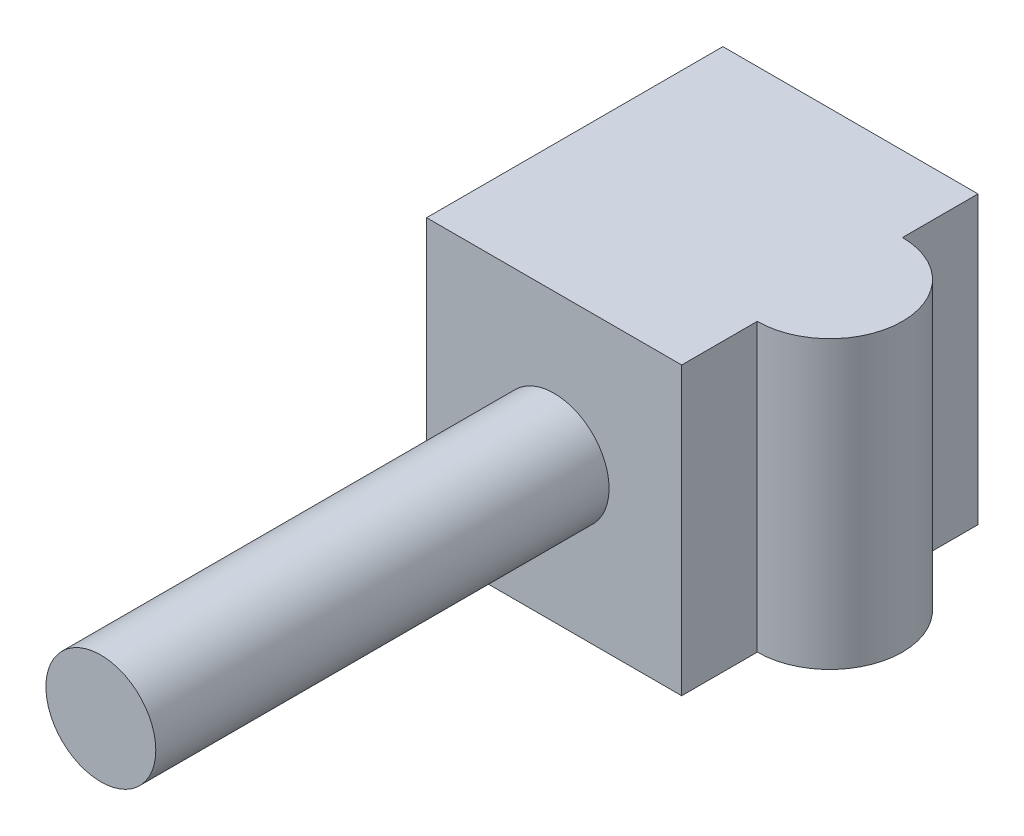
ISO-10303-21;
HEADER;
FILE_DESCRIPTION(('STEP AP214'),'2;1');
FILE_NAME('part.step','',(''),(''),'','','');
FILE_SCHEMA(('AUTOMOTIVE_DESIGN { 1 0 10303 214 1 1 1 1 }'));
ENDSEC;
DATA;
#1=APPLICATION_CONTEXT('core data for automotive mechanical design processes');
#2=APPLICATION_PROTOCOL_DEFINITION('international standard','automotive_design',2000,#1);
#3=PRODUCT_CONTEXT('',#1,'mechanical');
#4=PRODUCT('Part','Part','',(#3));
#5=PRODUCT_RELATED_PRODUCT_CATEGORY('part','',(#4));
#6=PRODUCT_DEFINITION_FORMATION('','',#4);
#7=PRODUCT_DEFINITION_CONTEXT('part definition',#1,'design');
#8=PRODUCT_DEFINITION('design','',#6,#7);
#9=PRODUCT_DEFINITION_SHAPE('','',#8);
#10=(LENGTH_UNIT() NAMED_UNIT(*) SI_UNIT(.MILLI.,.METRE.));
#11=(NAMED_UNIT(*) PLANE_ANGLE_UNIT() SI_UNIT($,.RADIAN.));
#12=(NAMED_UNIT(*) SI_UNIT($,.STERADIAN.) SOLID_ANGLE_UNIT());
#13=UNCERTAINTY_MEASURE_WITH_UNIT(LENGTH_MEASURE(1.E-05),#10,'distance_accuracy_value','');
#14=(GEOMETRIC_REPRESENTATION_CONTEXT(3) GLOBAL_UNCERTAINTY_ASSIGNED_CONTEXT((#13)) GLOBAL_UNIT_ASSIGNED_CONTEXT((#10,
#11,#12)) REPRESENTATION_CONTEXT('',''));
#15=CARTESIAN_POINT('',(0.,0.,0.));
#16=DIRECTION('',(0.,0.,1.));
#17=DIRECTION('',(1.,0.,0.));
#18=AXIS2_PLACEMENT_3D('',#15,#16,#17);
#19=CARTESIAN_POINT('',(32.5,36.5,37.75));
#20=DIRECTION('',(-1.,0.,0.));
#21=DIRECTION('',(0.,0.,1.));
#22=AXIS2_PLACEMENT_3D('',#19,#20,#21);
#23=PLANE('',#22);
#24=DIRECTION('',(0.,0.,-1.));
#25=VECTOR('',#24,1.);
#26=CARTESIAN_POINT('',(32.5,-36.5,37.75));
#27=LINE('',#26,#25);
#28=CARTESIAN_POINT('',(32.5,-36.5,37.75));
#29=VERTEX_POINT('',#28);
#30=CARTESIAN_POINT('',(32.5,-36.5,18.5));
#31=VERTEX_POINT('',#30);
#32=EDGE_CURVE('E109',#29,#31,#27,.T.);
#33=ORIENTED_EDGE('',*,*,#32,.T.);
#34=DIRECTION('',(0.,1.,0.));
#35=VECTOR('',#34,1.);
#36=CARTESIAN_POINT('',(32.5,-36.5,18.5));
#37=LINE('',#36,#35);
#38=CARTESIAN_POINT('',(32.5,36.5,18.5));
#39=VERTEX_POINT('',#38);
#40=EDGE_CURVE('E97',#31,#39,#37,.T.);
#41=ORIENTED_EDGE('',*,*,#40,.T.);
#42=DIRECTION('',(0.,0.,-1.));
#43=VECTOR('',#42,1.);
#44=CARTESIAN_POINT('',(32.5,36.5,37.75));
#45=LINE('',#44,#43);
#46=CARTESIAN_POINT('',(32.5,36.5,37.75));
#47=VERTEX_POINT('',#46);
#48=EDGE_CURVE('E11',#47,#39,#45,.T.);
#49=ORIENTED_EDGE('',*,*,#48,.F.);
#50=DIRECTION('',(0.,1.,0.));
#51=VECTOR('',#50,1.);
#52=CARTESIAN_POINT('',(32.5,36.5,37.75));
#53=LINE('',#52,#51);
#54=EDGE_CURVE('E112',#29,#47,#53,.T.);
#55=ORIENTED_EDGE('',*,*,#54,.F.);
#56=EDGE_LOOP('',(#33,#41,#49,#55));
#57=FACE_BOUND('',#56,.T.);
#58=ADVANCED_FACE('F37',(#57),#23,.F.);
#59=CARTESIAN_POINT('',(32.5,36.5,-18.5));
#60=VERTEX_POINT('',#59);
#61=CARTESIAN_POINT('',(32.5,36.5,-37.75));
#62=VERTEX_POINT('',#61);
#63=EDGE_CURVE('E45',#60,#62,#45,.T.);
#64=ORIENTED_EDGE('',*,*,#63,.F.);
#65=DIRECTION('',(0.,1.,0.));
#66=VECTOR('',#65,1.);
#67=CARTESIAN_POINT('',(32.5,-36.5,-18.5));
#68=LINE('',#67,#66);
#69=CARTESIAN_POINT('',(32.5,-36.5,-18.5));
#70=VERTEX_POINT('',#69);
#71=EDGE_CURVE('E105',#60,#70,#68,.F.);
#72=ORIENTED_EDGE('',*,*,#71,.T.);
#73=CARTESIAN_POINT('',(32.5,-36.5,-37.75));
#74=VERTEX_POINT('',#73);
#75=EDGE_CURVE('E81',#70,#74,#27,.T.);
#76=ORIENTED_EDGE('',*,*,#75,.T.);
#77=DIRECTION('',(0.,1.,0.));
#78=VECTOR('',#77,1.);
#79=CARTESIAN_POINT('',(32.5,36.5,-37.75));
#80=LINE('',#79,#78);
#81=EDGE_CURVE('E133',#74,#62,#80,.T.);
#82=ORIENTED_EDGE('',*,*,#81,.T.);
#83=EDGE_LOOP('',(#64,#72,#76,#82));
#84=FACE_BOUND('',#83,.T.);
#85=ADVANCED_FACE('F39',(#84),#23,.F.);
#86=CARTESIAN_POINT('',(-32.5,36.5,37.75));
#87=DIRECTION('',(0.,-1.,0.));
#88=DIRECTION('',(0.,0.,-1.));
#89=AXIS2_PLACEMENT_3D('',#86,#87,#88);
#90=PLANE('',#89);
#91=ORIENTED_EDGE('',*,*,#48,.T.);
#92=CARTESIAN_POINT('',(32.5,36.5,0.));
#93=DIRECTION('',(0.,1.,0.));
#94=DIRECTION('',(0.,0.,1.));
#95=AXIS2_PLACEMENT_3D('',#92,#93,#94);
#96=CIRCLE('',#95,18.5);
#97=EDGE_CURVE('E51',#39,#60,#96,.T.);
#98=ORIENTED_EDGE('',*,*,#97,.T.);
#99=ORIENTED_EDGE('',*,*,#63,.T.);
#100=DIRECTION('',(-1.,0.,0.));
#101=VECTOR('',#100,1.);
#102=CARTESIAN_POINT('',(-32.5,36.5,-37.75));
#103=LINE('',#102,#101);
#104=CARTESIAN_POINT('',(-32.5,36.5,-37.75));
#105=VERTEX_POINT('',#104);
#106=EDGE_CURVE('E128',#62,#105,#103,.T.);
#107=ORIENTED_EDGE('',*,*,#106,.T.);
#108=DIRECTION('',(0.,0.,-1.));
#109=VECTOR('',#108,1.);
#110=CARTESIAN_POINT('',(-32.5,36.5,37.75));
#111=LINE('',#110,#109);
#112=CARTESIAN_POINT('',(-32.5,36.5,37.75));
#113=VERTEX_POINT('',#112);
#114=EDGE_CURVE('E116',#113,#105,#111,.T.);
#115=ORIENTED_EDGE('',*,*,#114,.F.);
#116=DIRECTION('',(-1.,0.,0.));
#117=VECTOR('',#116,1.);
#118=CARTESIAN_POINT('',(-32.5,36.5,37.75));
#119=LINE('',#118,#117);
#120=EDGE_CURVE('E87',#47,#113,#119,.T.);
#121=ORIENTED_EDGE('',*,*,#120,.F.);
#122=EDGE_LOOP('',(#91,#98,#99,#107,#115,#121));
#123=FACE_BOUND('',#122,.T.);
#124=ADVANCED_FACE('F127',(#123),#90,.F.);
#125=CARTESIAN_POINT('',(-32.5,36.5,37.75));
#126=DIRECTION('',(1.,0.,0.));
#127=DIRECTION('',(0.,0.,-1.));
#128=AXIS2_PLACEMENT_3D('',#125,#126,#127);
#129=PLANE('',#128);
#130=DIRECTION('',(0.,-1.,0.));
#131=VECTOR('',#130,1.);
#132=CARTESIAN_POINT('',(-32.5,36.5,-37.75));
#133=LINE('',#132,#131);
#134=CARTESIAN_POINT('',(-32.5,-36.5,-37.75));
#135=VERTEX_POINT('',#134);
#136=EDGE_CURVE('E134',#105,#135,#133,.T.);
#137=ORIENTED_EDGE('',*,*,#136,.T.);
#138=DIRECTION('',(0.,0.,-1.));
#139=VECTOR('',#138,1.);
#140=CARTESIAN_POINT('',(-32.5,-36.5,37.75));
#141=LINE('',#140,#139);
#142=CARTESIAN_POINT('',(-32.5,-36.5,37.75));
#143=VERTEX_POINT('',#142);
#144=EDGE_CURVE('E113',#143,#135,#141,.T.);
#145=ORIENTED_EDGE('',*,*,#144,.F.);
#146=DIRECTION('',(0.,-1.,0.));
#147=VECTOR('',#146,1.);
#148=CARTESIAN_POINT('',(-32.5,36.5,37.75));
#149=LINE('',#148,#147);
#150=EDGE_CURVE('E145',#113,#143,#149,.T.);
#151=ORIENTED_EDGE('',*,*,#150,.F.);
#152=ORIENTED_EDGE('',*,*,#114,.T.);
#153=EDGE_LOOP('',(#137,#145,#151,#152));
#154=FACE_BOUND('',#153,.T.);
#155=ADVANCED_FACE('F149',(#154),#129,.F.);
#156=CARTESIAN_POINT('',(-32.5,-36.5,37.75));
#157=DIRECTION('',(0.,1.,0.));
#158=DIRECTION('',(0.,0.,1.));
#159=AXIS2_PLACEMENT_3D('',#156,#157,#158);
#160=PLANE('',#159);
#161=ORIENTED_EDGE('',*,*,#75,.F.);
#162=CARTESIAN_POINT('',(32.5,-36.5,0.));
#163=DIRECTION('',(0.,1.,0.));
#164=DIRECTION('',(0.,0.,1.));
#165=AXIS2_PLACEMENT_3D('',#162,#163,#164);
#166=CIRCLE('',#165,18.5);
#167=EDGE_CURVE('E100',#31,#70,#166,.T.);
#168=ORIENTED_EDGE('',*,*,#167,.F.);
#169=ORIENTED_EDGE('',*,*,#32,.F.);
#170=DIRECTION('',(1.,0.,0.));
#171=VECTOR('',#170,1.);
#172=CARTESIAN_POINT('',(-32.5,-36.5,37.75));
#173=LINE('',#172,#171);
#174=EDGE_CURVE('E60',#143,#29,#173,.T.);
#175=ORIENTED_EDGE('',*,*,#174,.F.);
#176=ORIENTED_EDGE('',*,*,#144,.T.);
#177=DIRECTION('',(1.,0.,0.));
#178=VECTOR('',#177,1.);
#179=CARTESIAN_POINT('',(-32.5,-36.5,-37.75));
#180=LINE('',#179,#178);
#181=EDGE_CURVE('E119',#135,#74,#180,.T.);
#182=ORIENTED_EDGE('',*,*,#181,.T.);
#183=EDGE_LOOP('',(#161,#168,#169,#175,#176,#182));
#184=FACE_BOUND('',#183,.T.);
#185=ADVANCED_FACE('F108',(#184),#160,.F.);
#186=CARTESIAN_POINT('',(0.,0.,37.75));
#187=DIRECTION('',(0.,0.,1.));
#188=DIRECTION('',(1.,0.,0.));
#189=AXIS2_PLACEMENT_3D('',#186,#187,#188);
#190=PLANE('',#189);
#191=CARTESIAN_POINT('',(0.,0.,37.75));
#192=DIRECTION('',(0.,0.,1.));
#193=DIRECTION('',(1.,0.,0.));
#194=AXIS2_PLACEMENT_3D('',#191,#192,#193);
#195=CIRCLE('',#194,14.);
#196=CARTESIAN_POINT('',(14.,0.,37.75));
#197=VERTEX_POINT('',#196);
#198=EDGE_CURVE('E104',#197,#197,#195,.T.);
#199=ORIENTED_EDGE('',*,*,#198,.F.);
#200=EDGE_LOOP('',(#199));
#201=FACE_BOUND('',#200,.T.);
#202=ORIENTED_EDGE('',*,*,#54,.T.);
#203=ORIENTED_EDGE('',*,*,#120,.T.);
#204=ORIENTED_EDGE('',*,*,#150,.T.);
#205=ORIENTED_EDGE('',*,*,#174,.T.);
#206=EDGE_LOOP('',(#202,#203,#204,#205));
#207=FACE_BOUND('',#206,.T.);
#208=ADVANCED_FACE('F148',(#201,#207),#190,.T.);
#209=CARTESIAN_POINT('',(0.,0.,-37.75));
#210=DIRECTION('',(0.,0.,1.));
#211=DIRECTION('',(1.,0.,0.));
#212=AXIS2_PLACEMENT_3D('',#209,#210,#211);
#213=PLANE('',#212);
#214=CARTESIAN_POINT('',(0.,0.,-37.75));
#215=DIRECTION('',(0.,0.,-1.));
#216=DIRECTION('',(-1.,0.,0.));
#217=AXIS2_PLACEMENT_3D('',#214,#215,#216);
#218=CIRCLE('',#217,9.);
#219=CARTESIAN_POINT('',(-9.,0.,-37.75));
#220=VERTEX_POINT('',#219);
#221=EDGE_CURVE('E136',#220,#220,#218,.T.);
#222=ORIENTED_EDGE('',*,*,#221,.F.);
#223=EDGE_LOOP('',(#222));
#224=FACE_BOUND('',#223,.T.);
#225=ORIENTED_EDGE('',*,*,#81,.F.);
#226=ORIENTED_EDGE('',*,*,#181,.F.);
#227=ORIENTED_EDGE('',*,*,#136,.F.);
#228=ORIENTED_EDGE('',*,*,#106,.F.);
#229=EDGE_LOOP('',(#225,#226,#227,#228));
#230=FACE_BOUND('',#229,.T.);
#231=ADVANCED_FACE('F131',(#224,#230),#213,.F.);
#232=CARTESIAN_POINT('',(0.,0.,67.75));
#233=DIRECTION('',(0.,0.,-1.));
#234=DIRECTION('',(-1.,0.,0.));
#235=AXIS2_PLACEMENT_3D('',#232,#233,#234);
#236=CYLINDRICAL_SURFACE('',#235,9.);
#237=CARTESIAN_POINT('',(0.,0.,37.75));
#238=DIRECTION('',(0.,0.,1.));
#239=DIRECTION('',(1.,0.,0.));
#240=AXIS2_PLACEMENT_3D('',#237,#238,#239);
#241=CIRCLE('',#240,9.);
#242=CARTESIAN_POINT('',(9.,0.,37.75));
#243=VERTEX_POINT('',#242);
#244=EDGE_CURVE('E139',#243,#243,#241,.F.);
#245=ORIENTED_EDGE('',*,*,#244,.F.);
#246=EDGE_LOOP('',(#245));
#247=FACE_BOUND('',#246,.T.);
#248=ORIENTED_EDGE('',*,*,#221,.T.);
#249=EDGE_LOOP('',(#248));
#250=FACE_BOUND('',#249,.T.);
#251=ADVANCED_FACE('F210',(#247,#250),#236,.F.);
#252=CARTESIAN_POINT('',(0.,0.,37.75));
#253=DIRECTION('',(0.,0.,1.));
#254=DIRECTION('',(1.,0.,0.));
#255=AXIS2_PLACEMENT_3D('',#252,#253,#254);
#256=PLANE('',#255);
#257=ORIENTED_EDGE('',*,*,#244,.T.);
#258=EDGE_LOOP('',(#257));
#259=FACE_BOUND('',#258,.T.);
#260=ADVANCED_FACE('F202',(#259),#256,.F.);
#261=CARTESIAN_POINT('',(0.,0.,153.25));
#262=DIRECTION('',(0.,0.,-1.));
#263=DIRECTION('',(-1.,0.,0.));
#264=AXIS2_PLACEMENT_3D('',#261,#262,#263);
#265=CYLINDRICAL_SURFACE('',#264,14.);
#266=CARTESIAN_POINT('',(0.,0.,153.25));
#267=DIRECTION('',(0.,0.,1.));
#268=DIRECTION('',(1.,0.,0.));
#269=AXIS2_PLACEMENT_3D('',#266,#267,#268);
#270=CIRCLE('',#269,14.);
#271=CARTESIAN_POINT('',(14.,0.,153.25));
#272=VERTEX_POINT('',#271);
#273=EDGE_CURVE('E262',#272,#272,#270,.T.);
#274=ORIENTED_EDGE('',*,*,#273,.F.);
#275=EDGE_LOOP('',(#274));
#276=FACE_BOUND('',#275,.T.);
#277=ORIENTED_EDGE('',*,*,#198,.T.);
#278=EDGE_LOOP('',(#277));
#279=FACE_BOUND('',#278,.T.);
#280=ADVANCED_FACE('F194',(#276,#279),#265,.T.);
#281=CARTESIAN_POINT('',(0.,0.,153.25));
#282=DIRECTION('',(0.,0.,1.));
#283=DIRECTION('',(1.,0.,0.));
#284=AXIS2_PLACEMENT_3D('',#281,#282,#283);
#285=PLANE('',#284);
#286=ORIENTED_EDGE('',*,*,#273,.T.);
#287=EDGE_LOOP('',(#286));
#288=FACE_BOUND('',#287,.T.);
#289=ADVANCED_FACE('F185',(#288),#285,.T.);
#290=CARTESIAN_POINT('',(32.5,-36.5,0.));
#291=DIRECTION('',(0.,1.,0.));
#292=DIRECTION('',(0.,0.,1.));
#293=AXIS2_PLACEMENT_3D('',#290,#291,#292);
#294=CYLINDRICAL_SURFACE('',#293,18.5);
#295=ORIENTED_EDGE('',*,*,#40,.F.);
#296=ORIENTED_EDGE('',*,*,#167,.T.);
#297=ORIENTED_EDGE('',*,*,#71,.F.);
#298=ORIENTED_EDGE('',*,*,#97,.F.);
#299=EDGE_LOOP('',(#295,#296,#297,#298));
#300=FACE_BOUND('',#299,.T.);
#301=ADVANCED_FACE('F99',(#300),#294,.T.);
#302=CLOSED_SHELL('',(#58,#85,#124,#155,#185,#208,#231,#251,#260,#280,#289,#301));
#303=MANIFOLD_SOLID_BREP('B2',#302);
#304=ADVANCED_BREP_SHAPE_REPRESENTATION('',(#18,#303),#14);
#305=SHAPE_DEFINITION_REPRESENTATION(#9,#304);
ENDSEC;
END-ISO-10303-21;
